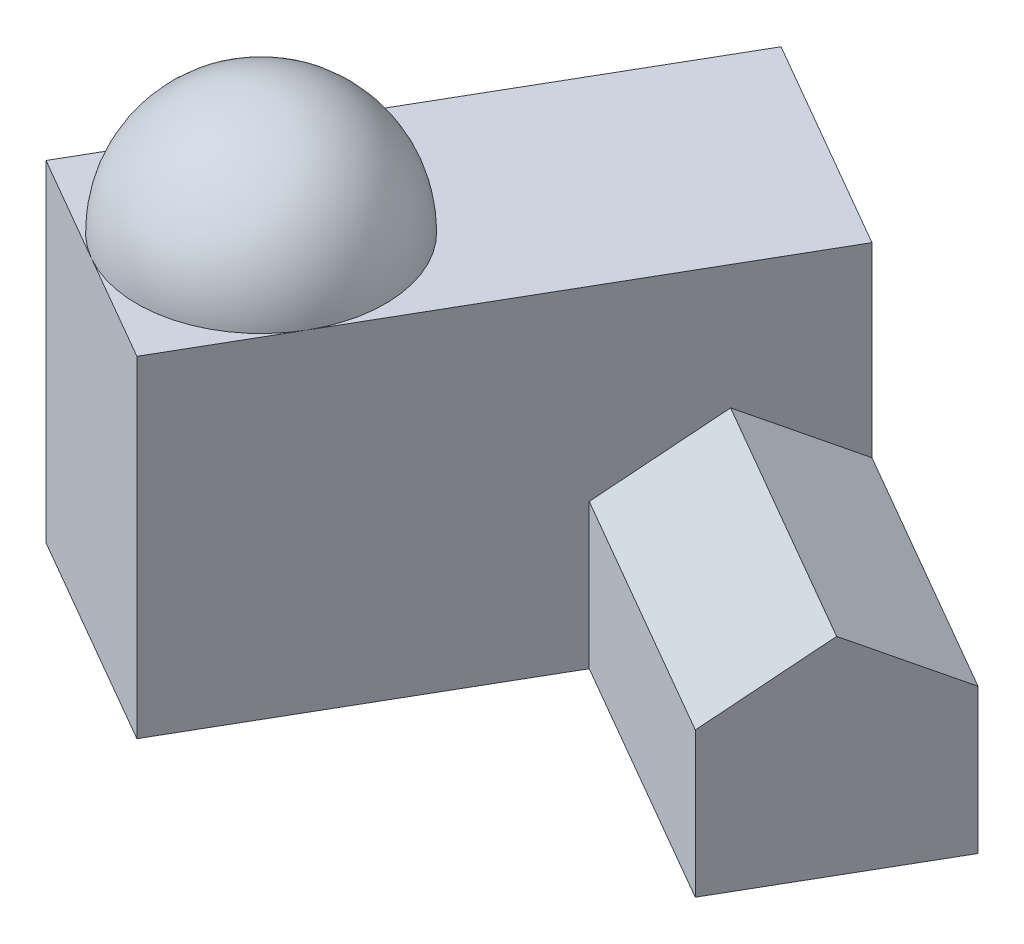
ISO-10303-21;
HEADER;
FILE_DESCRIPTION(('STEP AP214'),'2;1');
FILE_NAME('part.step','',(''),(''),'','','');
FILE_SCHEMA(('AUTOMOTIVE_DESIGN { 1 0 10303 214 1 1 1 1 }'));
ENDSEC;
DATA;
#1=APPLICATION_CONTEXT('core data for automotive mechanical design processes');
#2=APPLICATION_PROTOCOL_DEFINITION('international standard','automotive_design',2000,#1);
#3=PRODUCT_CONTEXT('',#1,'mechanical');
#4=PRODUCT('Part','Part','',(#3));
#5=PRODUCT_RELATED_PRODUCT_CATEGORY('part','',(#4));
#6=PRODUCT_DEFINITION_FORMATION('','',#4);
#7=PRODUCT_DEFINITION_CONTEXT('part definition',#1,'design');
#8=PRODUCT_DEFINITION('design','',#6,#7);
#9=PRODUCT_DEFINITION_SHAPE('','',#8);
#10=(LENGTH_UNIT() NAMED_UNIT(*) SI_UNIT(.MILLI.,.METRE.));
#11=(NAMED_UNIT(*) PLANE_ANGLE_UNIT() SI_UNIT($,.RADIAN.));
#12=(NAMED_UNIT(*) SI_UNIT($,.STERADIAN.) SOLID_ANGLE_UNIT());
#13=UNCERTAINTY_MEASURE_WITH_UNIT(LENGTH_MEASURE(1.E-05),#10,'distance_accuracy_value','');
#14=(GEOMETRIC_REPRESENTATION_CONTEXT(3) GLOBAL_UNCERTAINTY_ASSIGNED_CONTEXT((#13)) GLOBAL_UNIT_ASSIGNED_CONTEXT((#10,
#11,#12)) REPRESENTATION_CONTEXT('',''));
#15=CARTESIAN_POINT('',(0.,0.,0.));
#16=DIRECTION('',(0.,0.,1.));
#17=DIRECTION('',(1.,0.,0.));
#18=AXIS2_PLACEMENT_3D('',#15,#16,#17);
#19=CARTESIAN_POINT('',(-13.0384757729333,80.,142.583302491977));
#20=DIRECTION('',(-0.86602540378444,0.,-0.499999999999998));
#21=DIRECTION('',(-0.499999999999998,0.,0.86602540378444));
#22=AXIS2_PLACEMENT_3D('',#19,#20,#21);
#23=PLANE('',#22);
#24=DIRECTION('',(-0.428746462856272,-0.514495755427526,0.742610657232506));
#25=VECTOR('',#24,1.);
#26=CARTESIAN_POINT('',(26.9615242270664,35.,73.3012701892218));
#27=LINE('',#26,#25);
#28=CARTESIAN_POINT('',(39.4615242270665,50.,51.6506350946108));
#29=VERTEX_POINT('',#28);
#30=CARTESIAN_POINT('',(26.9615242270667,35.,73.3012701892216));
#31=VERTEX_POINT('',#30);
#32=EDGE_CURVE('E46',#29,#31,#27,.T.);
#33=ORIENTED_EDGE('',*,*,#32,.F.);
#34=DIRECTION('',(-0.428746462856272,0.514495755427526,0.742610657232506));
#35=VECTOR('',#34,1.);
#36=CARTESIAN_POINT('',(39.4615242270664,50.,51.6506350946108));
#37=LINE('',#36,#35);
#38=CARTESIAN_POINT('',(51.9615242270664,35.,29.9999999999998));
#39=VERTEX_POINT('',#38);
#40=EDGE_CURVE('E110',#39,#29,#37,.T.);
#41=ORIENTED_EDGE('',*,*,#40,.F.);
#42=DIRECTION('',(0.,-1.,0.));
#43=VECTOR('',#42,1.);
#44=CARTESIAN_POINT('',(51.9615242270664,80.,29.9999999999998));
#45=LINE('',#44,#43);
#46=CARTESIAN_POINT('',(51.9615242270664,80.,29.9999999999998));
#47=VERTEX_POINT('',#46);
#48=EDGE_CURVE('E164',#47,#39,#45,.T.);
#49=ORIENTED_EDGE('',*,*,#48,.F.);
#50=DIRECTION('',(0.499999999999998,0.,-0.86602540378444));
#51=VECTOR('',#50,1.);
#52=CARTESIAN_POINT('',(-13.0384757729333,80.,142.583302491977));
#53=LINE('',#52,#51);
#54=CARTESIAN_POINT('',(1.9615242270667,80.,116.602540378444));
#55=VERTEX_POINT('',#54);
#56=EDGE_CURVE('E160',#55,#47,#53,.T.);
#57=ORIENTED_EDGE('',*,*,#56,.F.);
#58=CARTESIAN_POINT('',(-13.0384757729333,80.,142.583302491977));
#59=VERTEX_POINT('',#58);
#60=EDGE_CURVE('E161',#59,#55,#53,.T.);
#61=ORIENTED_EDGE('',*,*,#60,.F.);
#62=DIRECTION('',(0.,-1.,0.));
#63=VECTOR('',#62,1.);
#64=CARTESIAN_POINT('',(-13.0384757729333,80.,142.583302491977));
#65=LINE('',#64,#63);
#66=CARTESIAN_POINT('',(-13.0384757729333,0.,142.583302491977));
#67=VERTEX_POINT('',#66);
#68=EDGE_CURVE('E167',#59,#67,#65,.T.);
#69=ORIENTED_EDGE('',*,*,#68,.T.);
#70=DIRECTION('',(0.499999999999998,0.,-0.86602540378444));
#71=VECTOR('',#70,1.);
#72=CARTESIAN_POINT('',(-13.0384757729333,0.,142.583302491977));
#73=LINE('',#72,#71);
#74=CARTESIAN_POINT('',(26.9615242270665,0.,73.3012701892219));
#75=VERTEX_POINT('',#74);
#76=EDGE_CURVE('E148',#67,#75,#73,.T.);
#77=ORIENTED_EDGE('',*,*,#76,.T.);
#78=DIRECTION('',(0.,-1.,0.));
#79=VECTOR('',#78,1.);
#80=CARTESIAN_POINT('',(26.9615242270667,35.,73.3012701892219));
#81=LINE('',#80,#79);
#82=EDGE_CURVE('E51',#31,#75,#81,.T.);
#83=ORIENTED_EDGE('',*,*,#82,.F.);
#84=EDGE_LOOP('',(#33,#41,#49,#57,#61,#69,#77,#83));
#85=FACE_BOUND('',#84,.T.);
#86=ADVANCED_FACE('F30',(#85),#23,.F.);
#87=CARTESIAN_POINT('',(51.9615242270664,80.,29.9999999999998));
#88=DIRECTION('',(0.,-1.,0.));
#89=DIRECTION('',(0.,0.,-1.));
#90=AXIS2_PLACEMENT_3D('',#87,#88,#89);
#91=PLANE('',#90);
#92=CARTESIAN_POINT('',(-24.0192378864666,80.,101.602540378444));
#93=DIRECTION('',(0.,-1.,0.));
#94=DIRECTION('',(0.,0.,-1.));
#95=AXIS2_PLACEMENT_3D('',#92,#93,#94);
#96=CIRCLE('',#95,30.0000000000002);
#97=CARTESIAN_POINT('',(-49.9999999999997,80.,86.6025403784439));
#98=VERTEX_POINT('',#97);
#99=CARTESIAN_POINT('',(-39.0192378864666,80.,127.583302491977));
#100=VERTEX_POINT('',#99);
#101=EDGE_CURVE('E11',#98,#100,#96,.F.);
#102=ORIENTED_EDGE('',*,*,#101,.F.);
#103=DIRECTION('',(-0.499999999999998,0.,0.86602540378444));
#104=VECTOR('',#103,1.);
#105=CARTESIAN_POINT('',(0.,80.,0.));
#106=LINE('',#105,#104);
#107=CARTESIAN_POINT('',(-64.9999999999997,80.,112.583302491977));
#108=VERTEX_POINT('',#107);
#109=EDGE_CURVE('E153',#98,#108,#106,.T.);
#110=ORIENTED_EDGE('',*,*,#109,.T.);
#111=DIRECTION('',(0.86602540378444,0.,0.499999999999997));
#112=VECTOR('',#111,1.);
#113=CARTESIAN_POINT('',(-64.9999999999997,80.,112.583302491977));
#114=LINE('',#113,#112);
#115=EDGE_CURVE('E157',#108,#100,#114,.T.);
#116=ORIENTED_EDGE('',*,*,#115,.T.);
#117=EDGE_LOOP('',(#102,#110,#116));
#118=FACE_BOUND('',#117,.T.);
#119=ADVANCED_FACE('F190',(#118),#91,.F.);
#120=EDGE_CURVE('E39',#100,#55,#96,.F.);
#121=ORIENTED_EDGE('',*,*,#120,.F.);
#122=EDGE_CURVE('E156',#100,#59,#114,.T.);
#123=ORIENTED_EDGE('',*,*,#122,.T.);
#124=ORIENTED_EDGE('',*,*,#60,.T.);
#125=EDGE_LOOP('',(#121,#123,#124));
#126=FACE_BOUND('',#125,.T.);
#127=ADVANCED_FACE('F183',(#126),#91,.F.);
#128=EDGE_CURVE('E34',#55,#98,#96,.F.);
#129=ORIENTED_EDGE('',*,*,#128,.F.);
#130=ORIENTED_EDGE('',*,*,#56,.T.);
#131=DIRECTION('',(-0.86602540378444,0.,-0.499999999999997));
#132=VECTOR('',#131,1.);
#133=CARTESIAN_POINT('',(51.9615242270664,80.,29.9999999999998));
#134=LINE('',#133,#132);
#135=CARTESIAN_POINT('',(0.,80.,0.));
#136=VERTEX_POINT('',#135);
#137=EDGE_CURVE('E150',#47,#136,#134,.T.);
#138=ORIENTED_EDGE('',*,*,#137,.T.);
#139=EDGE_CURVE('E154',#136,#98,#106,.T.);
#140=ORIENTED_EDGE('',*,*,#139,.T.);
#141=EDGE_LOOP('',(#129,#130,#138,#140));
#142=FACE_BOUND('',#141,.T.);
#143=ADVANCED_FACE('F204',(#142),#91,.F.);
#144=CARTESIAN_POINT('',(51.9615242270664,80.,29.9999999999998));
#145=DIRECTION('',(-0.499999999999997,0.,0.86602540378444));
#146=DIRECTION('',(0.86602540378444,0.,0.499999999999997));
#147=AXIS2_PLACEMENT_3D('',#144,#145,#146);
#148=PLANE('',#147);
#149=DIRECTION('',(-0.86602540378444,0.,-0.499999999999997));
#150=VECTOR('',#149,1.);
#151=CARTESIAN_POINT('',(51.9615242270664,0.,29.9999999999998));
#152=LINE('',#151,#150);
#153=CARTESIAN_POINT('',(112.583302491977,0.,64.9999999999998));
#154=VERTEX_POINT('',#153);
#155=CARTESIAN_POINT('',(0.,0.,0.));
#156=VERTEX_POINT('',#155);
#157=EDGE_CURVE('E141',#154,#156,#152,.T.);
#158=ORIENTED_EDGE('',*,*,#157,.T.);
#159=DIRECTION('',(0.,-1.,0.));
#160=VECTOR('',#159,1.);
#161=CARTESIAN_POINT('',(0.,80.,0.));
#162=LINE('',#161,#160);
#163=EDGE_CURVE('E172',#136,#156,#162,.T.);
#164=ORIENTED_EDGE('',*,*,#163,.F.);
#165=ORIENTED_EDGE('',*,*,#137,.F.);
#166=ORIENTED_EDGE('',*,*,#48,.T.);
#167=DIRECTION('',(-0.866025403784439,0.,-0.5));
#168=VECTOR('',#167,1.);
#169=CARTESIAN_POINT('',(51.9615242270664,35.,29.9999999999998));
#170=LINE('',#169,#168);
#171=CARTESIAN_POINT('',(112.583302491977,35.,64.9999999999998));
#172=VERTEX_POINT('',#171);
#173=EDGE_CURVE('E135',#172,#39,#170,.T.);
#174=ORIENTED_EDGE('',*,*,#173,.F.);
#175=DIRECTION('',(0.,-1.,0.));
#176=VECTOR('',#175,1.);
#177=CARTESIAN_POINT('',(112.583302491977,35.,64.9999999999998));
#178=LINE('',#177,#176);
#179=EDGE_CURVE('E126',#172,#154,#178,.T.);
#180=ORIENTED_EDGE('',*,*,#179,.T.);
#181=EDGE_LOOP('',(#158,#164,#165,#166,#174,#180));
#182=FACE_BOUND('',#181,.T.);
#183=ADVANCED_FACE('F32',(#182),#148,.F.);
#184=CARTESIAN_POINT('',(0.,80.,0.));
#185=DIRECTION('',(0.86602540378444,0.,0.499999999999998));
#186=DIRECTION('',(0.499999999999998,0.,-0.86602540378444));
#187=AXIS2_PLACEMENT_3D('',#184,#185,#186);
#188=PLANE('',#187);
#189=DIRECTION('',(-0.499999999999998,0.,0.86602540378444));
#190=VECTOR('',#189,1.);
#191=CARTESIAN_POINT('',(0.,0.,0.));
#192=LINE('',#191,#190);
#193=CARTESIAN_POINT('',(-64.9999999999997,0.,112.583302491977));
#194=VERTEX_POINT('',#193);
#195=EDGE_CURVE('E144',#156,#194,#192,.T.);
#196=ORIENTED_EDGE('',*,*,#195,.T.);
#197=DIRECTION('',(0.,-1.,0.));
#198=VECTOR('',#197,1.);
#199=CARTESIAN_POINT('',(-64.9999999999997,80.,112.583302491977));
#200=LINE('',#199,#198);
#201=EDGE_CURVE('E170',#108,#194,#200,.T.);
#202=ORIENTED_EDGE('',*,*,#201,.F.);
#203=ORIENTED_EDGE('',*,*,#109,.F.);
#204=ORIENTED_EDGE('',*,*,#139,.F.);
#205=ORIENTED_EDGE('',*,*,#163,.T.);
#206=EDGE_LOOP('',(#196,#202,#203,#204,#205));
#207=FACE_BOUND('',#206,.T.);
#208=ADVANCED_FACE('F193',(#207),#188,.F.);
#209=CARTESIAN_POINT('',(-64.9999999999997,80.,112.583302491977));
#210=DIRECTION('',(0.499999999999997,0.,-0.86602540378444));
#211=DIRECTION('',(-0.86602540378444,0.,-0.499999999999997));
#212=AXIS2_PLACEMENT_3D('',#209,#210,#211);
#213=PLANE('',#212);
#214=DIRECTION('',(0.86602540378444,0.,0.499999999999997));
#215=VECTOR('',#214,1.);
#216=CARTESIAN_POINT('',(-64.9999999999997,0.,112.583302491977));
#217=LINE('',#216,#215);
#218=EDGE_CURVE('E146',#194,#67,#217,.T.);
#219=ORIENTED_EDGE('',*,*,#218,.T.);
#220=ORIENTED_EDGE('',*,*,#68,.F.);
#221=ORIENTED_EDGE('',*,*,#122,.F.);
#222=ORIENTED_EDGE('',*,*,#115,.F.);
#223=ORIENTED_EDGE('',*,*,#201,.T.);
#224=EDGE_LOOP('',(#219,#220,#221,#222,#223));
#225=FACE_BOUND('',#224,.T.);
#226=ADVANCED_FACE('F188',(#225),#213,.F.);
#227=CARTESIAN_POINT('',(51.9615242270664,0.,29.9999999999998));
#228=DIRECTION('',(0.,-1.,0.));
#229=DIRECTION('',(0.,0.,-1.));
#230=AXIS2_PLACEMENT_3D('',#227,#228,#229);
#231=PLANE('',#230);
#232=ORIENTED_EDGE('',*,*,#157,.F.);
#233=DIRECTION('',(0.5,0.,-0.866025403784439));
#234=VECTOR('',#233,1.);
#235=CARTESIAN_POINT('',(112.583302491977,0.,64.9999999999998));
#236=LINE('',#235,#234);
#237=CARTESIAN_POINT('',(87.5833024919771,0.,108.301270189222));
#238=VERTEX_POINT('',#237);
#239=EDGE_CURVE('E132',#238,#154,#236,.T.);
#240=ORIENTED_EDGE('',*,*,#239,.F.);
#241=DIRECTION('',(0.866025403784439,0.,0.5));
#242=VECTOR('',#241,1.);
#243=CARTESIAN_POINT('',(87.5833024919771,0.,108.301270189222));
#244=LINE('',#243,#242);
#245=EDGE_CURVE('E112',#75,#238,#244,.T.);
#246=ORIENTED_EDGE('',*,*,#245,.F.);
#247=ORIENTED_EDGE('',*,*,#76,.F.);
#248=ORIENTED_EDGE('',*,*,#218,.F.);
#249=ORIENTED_EDGE('',*,*,#195,.F.);
#250=EDGE_LOOP('',(#232,#240,#246,#247,#248,#249));
#251=FACE_BOUND('',#250,.T.);
#252=ADVANCED_FACE('F197',(#251),#231,.T.);
#253=CARTESIAN_POINT('',(-24.0192378864666,80.,101.602540378444));
#254=DIRECTION('',(0.,0.,-1.));
#255=DIRECTION('',(1.,0.,0.));
#256=AXIS2_PLACEMENT_3D('',#253,#254,#255);
#257=SPHERICAL_SURFACE('',#256,30.0000000000002);
#258=CARTESIAN_POINT('',(-24.0192378864666,80.,101.602540378444));
#259=DIRECTION('',(0.,-1.,0.));
#260=DIRECTION('',(0.,0.,-1.));
#261=AXIS2_PLACEMENT_3D('',#258,#259,#260);
#262=SPHERICAL_SURFACE('',#261,30.0000000000002);
#263=ORIENTED_EDGE('',*,*,#128,.T.);
#264=ORIENTED_EDGE('',*,*,#101,.T.);
#265=ORIENTED_EDGE('',*,*,#120,.T.);
#266=EDGE_LOOP('',(#263,#264,#265));
#267=FACE_BOUND('',#266,.T.);
#268=ADVANCED_FACE('F179',(#267),#262,.T.);
#269=CARTESIAN_POINT('',(87.5833024919771,35.,108.301270189222));
#270=DIRECTION('',(0.5,0.,-0.866025403784439));
#271=DIRECTION('',(-0.866025403784439,0.,-0.5));
#272=AXIS2_PLACEMENT_3D('',#269,#270,#271);
#273=PLANE('',#272);
#274=ORIENTED_EDGE('',*,*,#245,.T.);
#275=DIRECTION('',(0.,-1.,0.));
#276=VECTOR('',#275,1.);
#277=CARTESIAN_POINT('',(87.5833024919771,35.,108.301270189222));
#278=LINE('',#277,#276);
#279=CARTESIAN_POINT('',(87.5833024919771,35.,108.301270189222));
#280=VERTEX_POINT('',#279);
#281=EDGE_CURVE('E138',#280,#238,#278,.T.);
#282=ORIENTED_EDGE('',*,*,#281,.F.);
#283=DIRECTION('',(0.866025403784439,0.,0.5));
#284=VECTOR('',#283,1.);
#285=CARTESIAN_POINT('',(87.5833024919771,35.,108.301270189222));
#286=LINE('',#285,#284);
#287=EDGE_CURVE('E118',#31,#280,#286,.T.);
#288=ORIENTED_EDGE('',*,*,#287,.F.);
#289=ORIENTED_EDGE('',*,*,#82,.T.);
#290=EDGE_LOOP('',(#274,#282,#288,#289));
#291=FACE_BOUND('',#290,.T.);
#292=ADVANCED_FACE('F207',(#291),#273,.F.);
#293=CARTESIAN_POINT('',(112.583302491977,35.,64.9999999999998));
#294=DIRECTION('',(-0.866025403784439,0.,-0.5));
#295=DIRECTION('',(-0.5,0.,0.866025403784439));
#296=AXIS2_PLACEMENT_3D('',#293,#294,#295);
#297=PLANE('',#296);
#298=ORIENTED_EDGE('',*,*,#239,.T.);
#299=ORIENTED_EDGE('',*,*,#179,.F.);
#300=DIRECTION('',(-0.428746462856272,0.514495755427526,0.742610657232506));
#301=VECTOR('',#300,1.);
#302=CARTESIAN_POINT('',(100.083302491977,50.,86.6506350946108));
#303=LINE('',#302,#301);
#304=CARTESIAN_POINT('',(100.083302491977,50.,86.6506350946108));
#305=VERTEX_POINT('',#304);
#306=EDGE_CURVE('E109',#172,#305,#303,.T.);
#307=ORIENTED_EDGE('',*,*,#306,.T.);
#308=DIRECTION('',(-0.428746462856272,-0.514495755427526,0.742610657232506));
#309=VECTOR('',#308,1.);
#310=CARTESIAN_POINT('',(87.5833024919771,35.,108.301270189222));
#311=LINE('',#310,#309);
#312=EDGE_CURVE('E116',#305,#280,#311,.T.);
#313=ORIENTED_EDGE('',*,*,#312,.T.);
#314=ORIENTED_EDGE('',*,*,#281,.T.);
#315=EDGE_LOOP('',(#298,#299,#307,#313,#314));
#316=FACE_BOUND('',#315,.T.);
#317=ADVANCED_FACE('F124',(#316),#297,.F.);
#318=CARTESIAN_POINT('',(39.4615242270664,50.,51.6506350946108));
#319=DIRECTION('',(0.257247877713763,0.857492925712544,-0.445566394339503));
#320=DIRECTION('',(0.,0.461083967620704,0.887356509416114));
#321=AXIS2_PLACEMENT_3D('',#318,#319,#320);
#322=PLANE('',#321);
#323=ORIENTED_EDGE('',*,*,#306,.F.);
#324=ORIENTED_EDGE('',*,*,#173,.T.);
#325=ORIENTED_EDGE('',*,*,#40,.T.);
#326=DIRECTION('',(0.866025403784439,0.,0.5));
#327=VECTOR('',#326,1.);
#328=CARTESIAN_POINT('',(39.4615242270664,50.,51.6506350946108));
#329=LINE('',#328,#327);
#330=EDGE_CURVE('E104',#29,#305,#329,.T.);
#331=ORIENTED_EDGE('',*,*,#330,.T.);
#332=EDGE_LOOP('',(#323,#324,#325,#331));
#333=FACE_BOUND('',#332,.T.);
#334=ADVANCED_FACE('F106',(#333),#322,.T.);
#335=CARTESIAN_POINT('',(26.9615242270664,35.,73.3012701892218));
#336=DIRECTION('',(-0.257247877713763,0.857492925712544,0.445566394339503));
#337=DIRECTION('',(0.,-0.461083967620704,0.887356509416114));
#338=AXIS2_PLACEMENT_3D('',#335,#336,#337);
#339=PLANE('',#338);
#340=ORIENTED_EDGE('',*,*,#312,.F.);
#341=ORIENTED_EDGE('',*,*,#330,.F.);
#342=ORIENTED_EDGE('',*,*,#32,.T.);
#343=ORIENTED_EDGE('',*,*,#287,.T.);
#344=EDGE_LOOP('',(#340,#341,#342,#343));
#345=FACE_BOUND('',#344,.T.);
#346=ADVANCED_FACE('F117',(#345),#339,.T.);
#347=CLOSED_SHELL('',(#86,#119,#127,#143,#183,#208,#226,#252,#268,#292,#317,#334,#346));
#348=MANIFOLD_SOLID_BREP('B2',#347);
#349=ADVANCED_BREP_SHAPE_REPRESENTATION('',(#18,#348),#14);
#350=SHAPE_DEFINITION_REPRESENTATION(#9,#349);
ENDSEC;
END-ISO-10303-21;
